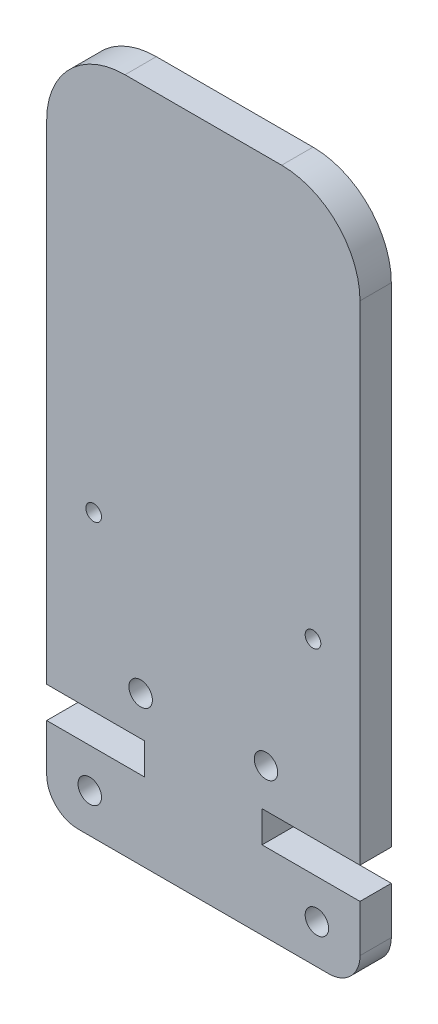
ISO-10303-21;
HEADER;
FILE_DESCRIPTION(('STEP AP214'),'2;1');
FILE_NAME('part.step','',(''),(''),'','','');
FILE_SCHEMA(('AUTOMOTIVE_DESIGN { 1 0 10303 214 1 1 1 1 }'));
ENDSEC;
DATA;
#1=APPLICATION_CONTEXT('core data for automotive mechanical design processes');
#2=APPLICATION_PROTOCOL_DEFINITION('international standard','automotive_design',2000,#1);
#3=PRODUCT_CONTEXT('',#1,'mechanical');
#4=PRODUCT('Part','Part','',(#3));
#5=PRODUCT_RELATED_PRODUCT_CATEGORY('part','',(#4));
#6=PRODUCT_DEFINITION_FORMATION('','',#4);
#7=PRODUCT_DEFINITION_CONTEXT('part definition',#1,'design');
#8=PRODUCT_DEFINITION('design','',#6,#7);
#9=PRODUCT_DEFINITION_SHAPE('','',#8);
#10=(LENGTH_UNIT() NAMED_UNIT(*) SI_UNIT(.MILLI.,.METRE.));
#11=(NAMED_UNIT(*) PLANE_ANGLE_UNIT() SI_UNIT($,.RADIAN.));
#12=(NAMED_UNIT(*) SI_UNIT($,.STERADIAN.) SOLID_ANGLE_UNIT());
#13=UNCERTAINTY_MEASURE_WITH_UNIT(LENGTH_MEASURE(1.E-05),#10,'distance_accuracy_value','');
#14=(GEOMETRIC_REPRESENTATION_CONTEXT(3) GLOBAL_UNCERTAINTY_ASSIGNED_CONTEXT((#13)) GLOBAL_UNIT_ASSIGNED_CONTEXT((#10,
#11,#12)) REPRESENTATION_CONTEXT('',''));
#15=CARTESIAN_POINT('',(0.,0.,0.));
#16=DIRECTION('',(0.,0.,1.));
#17=DIRECTION('',(1.,0.,0.));
#18=AXIS2_PLACEMENT_3D('',#15,#16,#17);
#19=CARTESIAN_POINT('',(18.,2.,2.));
#20=DIRECTION('',(0.,0.,1.));
#21=DIRECTION('',(1.,0.,0.));
#22=AXIS2_PLACEMENT_3D('',#19,#20,#21);
#23=PLANE('',#22);
#24=CARTESIAN_POINT('',(17.2500000000022,2.49999999999995,2.));
#25=DIRECTION('',(0.,0.,1.));
#26=DIRECTION('',(1.,0.,0.));
#27=AXIS2_PLACEMENT_3D('',#24,#25,#26);
#28=CIRCLE('',#27,0.749999999999969);
#29=CARTESIAN_POINT('',(18.0000000000022,2.49999999999995,2.));
#30=VERTEX_POINT('',#29);
#31=EDGE_CURVE('E352',#30,#30,#28,.T.);
#32=ORIENTED_EDGE('',*,*,#31,.F.);
#33=EDGE_LOOP('',(#32));
#34=FACE_BOUND('',#33,.T.);
#35=CARTESIAN_POINT('',(14.0000000000031,9.50000000000006,2.));
#36=DIRECTION('',(0.,0.,1.));
#37=DIRECTION('',(1.,0.,0.));
#38=AXIS2_PLACEMENT_3D('',#35,#36,#37);
#39=CIRCLE('',#38,0.750000000000027);
#40=CARTESIAN_POINT('',(14.7500000000031,9.50000000000006,2.));
#41=VERTEX_POINT('',#40);
#42=EDGE_CURVE('E364',#41,#41,#39,.T.);
#43=ORIENTED_EDGE('',*,*,#42,.F.);
#44=EDGE_LOOP('',(#43));
#45=FACE_BOUND('',#44,.T.);
#46=CARTESIAN_POINT('',(3.00000000000211,18.,2.));
#47=DIRECTION('',(0.,0.,1.));
#48=DIRECTION('',(1.,0.,0.));
#49=AXIS2_PLACEMENT_3D('',#46,#47,#48);
#50=CIRCLE('',#49,0.499999999999946);
#51=CARTESIAN_POINT('',(3.50000000000205,18.,2.));
#52=VERTEX_POINT('',#51);
#53=EDGE_CURVE('E182',#52,#52,#50,.T.);
#54=ORIENTED_EDGE('',*,*,#53,.F.);
#55=EDGE_LOOP('',(#54));
#56=FACE_BOUND('',#55,.T.);
#57=CARTESIAN_POINT('',(18.,2.,2.));
#58=DIRECTION('',(0.,0.,1.));
#59=DIRECTION('',(1.,0.,0.));
#60=AXIS2_PLACEMENT_3D('',#57,#58,#59);
#61=CIRCLE('',#60,2.);
#62=CARTESIAN_POINT('',(18.,0.,2.));
#63=VERTEX_POINT('',#62);
#64=CARTESIAN_POINT('',(20.,2.,2.));
#65=VERTEX_POINT('',#64);
#66=EDGE_CURVE('E209',#63,#65,#61,.T.);
#67=ORIENTED_EDGE('',*,*,#66,.T.);
#68=DIRECTION('',(0.,1.,0.));
#69=VECTOR('',#68,1.);
#70=CARTESIAN_POINT('',(20.,5.00000000000012,2.));
#71=LINE('',#70,#69);
#72=CARTESIAN_POINT('',(20.,5.00000000000012,2.));
#73=VERTEX_POINT('',#72);
#74=EDGE_CURVE('E117',#65,#73,#71,.T.);
#75=ORIENTED_EDGE('',*,*,#74,.T.);
#76=DIRECTION('',(-1.,0.,0.));
#77=VECTOR('',#76,1.);
#78=CARTESIAN_POINT('',(13.749999999998,5.00000000000012,2.));
#79=LINE('',#78,#77);
#80=CARTESIAN_POINT('',(13.749999999998,5.00000000000012,2.));
#81=VERTEX_POINT('',#80);
#82=EDGE_CURVE('E248',#73,#81,#79,.T.);
#83=ORIENTED_EDGE('',*,*,#82,.T.);
#84=DIRECTION('',(0.,1.,0.));
#85=VECTOR('',#84,1.);
#86=CARTESIAN_POINT('',(13.749999999998,5.00000000000012,2.));
#87=LINE('',#86,#85);
#88=CARTESIAN_POINT('',(13.749999999998,7.00000000000012,2.));
#89=VERTEX_POINT('',#88);
#90=EDGE_CURVE('E267',#81,#89,#87,.T.);
#91=ORIENTED_EDGE('',*,*,#90,.T.);
#92=DIRECTION('',(1.,0.,0.));
#93=VECTOR('',#92,1.);
#94=CARTESIAN_POINT('',(13.749999999998,7.00000000000012,2.));
#95=LINE('',#94,#93);
#96=CARTESIAN_POINT('',(20.,7.00000000000012,2.));
#97=VERTEX_POINT('',#96);
#98=EDGE_CURVE('E264',#89,#97,#95,.T.);
#99=ORIENTED_EDGE('',*,*,#98,.T.);
#100=DIRECTION('',(0.,1.,0.));
#101=VECTOR('',#100,1.);
#102=CARTESIAN_POINT('',(20.,7.00000000000012,2.));
#103=LINE('',#102,#101);
#104=CARTESIAN_POINT('',(20.,38.2000000000002,2.));
#105=VERTEX_POINT('',#104);
#106=EDGE_CURVE('E266',#97,#105,#103,.T.);
#107=ORIENTED_EDGE('',*,*,#106,.T.);
#108=CARTESIAN_POINT('',(15.,38.2000000000002,2.));
#109=DIRECTION('',(0.,0.,1.));
#110=DIRECTION('',(1.,0.,0.));
#111=AXIS2_PLACEMENT_3D('',#108,#109,#110);
#112=CIRCLE('',#111,5.);
#113=CARTESIAN_POINT('',(15.,43.2000000000002,2.));
#114=VERTEX_POINT('',#113);
#115=EDGE_CURVE('E269',#105,#114,#112,.T.);
#116=ORIENTED_EDGE('',*,*,#115,.T.);
#117=DIRECTION('',(-1.,0.,0.));
#118=VECTOR('',#117,1.);
#119=CARTESIAN_POINT('',(5.,43.2000000000002,2.));
#120=LINE('',#119,#118);
#121=CARTESIAN_POINT('',(5.,43.2000000000002,2.));
#122=VERTEX_POINT('',#121);
#123=EDGE_CURVE('E275',#114,#122,#120,.T.);
#124=ORIENTED_EDGE('',*,*,#123,.T.);
#125=CARTESIAN_POINT('',(5.,38.2000000000002,2.));
#126=DIRECTION('',(0.,0.,1.));
#127=DIRECTION('',(1.,0.,0.));
#128=AXIS2_PLACEMENT_3D('',#125,#126,#127);
#129=CIRCLE('',#128,5.);
#130=CARTESIAN_POINT('',(0.,38.2000000000002,2.));
#131=VERTEX_POINT('',#130);
#132=EDGE_CURVE('E277',#122,#131,#129,.T.);
#133=ORIENTED_EDGE('',*,*,#132,.T.);
#134=DIRECTION('',(0.,-1.,0.));
#135=VECTOR('',#134,1.);
#136=CARTESIAN_POINT('',(0.,38.2000000000002,2.));
#137=LINE('',#136,#135);
#138=CARTESIAN_POINT('',(0.,7.00000000000012,2.));
#139=VERTEX_POINT('',#138);
#140=EDGE_CURVE('E279',#131,#139,#137,.T.);
#141=ORIENTED_EDGE('',*,*,#140,.T.);
#142=DIRECTION('',(1.,0.,0.));
#143=VECTOR('',#142,1.);
#144=CARTESIAN_POINT('',(6.25000000000197,7.00000000000012,2.));
#145=LINE('',#144,#143);
#146=CARTESIAN_POINT('',(6.25000000000197,7.00000000000012,2.));
#147=VERTEX_POINT('',#146);
#148=EDGE_CURVE('E281',#139,#147,#145,.T.);
#149=ORIENTED_EDGE('',*,*,#148,.T.);
#150=DIRECTION('',(0.,-1.,0.));
#151=VECTOR('',#150,1.);
#152=CARTESIAN_POINT('',(6.25000000000197,5.00000000000012,2.));
#153=LINE('',#152,#151);
#154=CARTESIAN_POINT('',(6.25000000000197,5.00000000000012,2.));
#155=VERTEX_POINT('',#154);
#156=EDGE_CURVE('E283',#147,#155,#153,.T.);
#157=ORIENTED_EDGE('',*,*,#156,.T.);
#158=DIRECTION('',(-1.,0.,0.));
#159=VECTOR('',#158,1.);
#160=CARTESIAN_POINT('',(6.25000000000197,5.00000000000012,2.));
#161=LINE('',#160,#159);
#162=CARTESIAN_POINT('',(0.,5.00000000000012,2.));
#163=VERTEX_POINT('',#162);
#164=EDGE_CURVE('E160',#155,#163,#161,.T.);
#165=ORIENTED_EDGE('',*,*,#164,.T.);
#166=DIRECTION('',(0.,-1.,0.));
#167=VECTOR('',#166,1.);
#168=CARTESIAN_POINT('',(0.,5.00000000000012,2.));
#169=LINE('',#168,#167);
#170=CARTESIAN_POINT('',(0.,2.,2.));
#171=VERTEX_POINT('',#170);
#172=EDGE_CURVE('E154',#163,#171,#169,.T.);
#173=ORIENTED_EDGE('',*,*,#172,.T.);
#174=CARTESIAN_POINT('',(2.,2.,2.));
#175=DIRECTION('',(0.,0.,1.));
#176=DIRECTION('',(1.,0.,0.));
#177=AXIS2_PLACEMENT_3D('',#174,#175,#176);
#178=CIRCLE('',#177,2.);
#179=CARTESIAN_POINT('',(2.,0.,2.));
#180=VERTEX_POINT('',#179);
#181=EDGE_CURVE('E158',#171,#180,#178,.T.);
#182=ORIENTED_EDGE('',*,*,#181,.T.);
#183=DIRECTION('',(1.,0.,0.));
#184=VECTOR('',#183,1.);
#185=CARTESIAN_POINT('',(2.,0.,2.));
#186=LINE('',#185,#184);
#187=EDGE_CURVE('E50',#180,#63,#186,.T.);
#188=ORIENTED_EDGE('',*,*,#187,.T.);
#189=EDGE_LOOP('',(#67,#75,#83,#91,#99,#107,#116,#124,#133,#141,#149,#157,#165,#173,#182,#188));
#190=FACE_BOUND('',#189,.T.);
#191=CARTESIAN_POINT('',(17.0000000000021,18.,2.));
#192=DIRECTION('',(0.,0.,1.));
#193=DIRECTION('',(1.,0.,0.));
#194=AXIS2_PLACEMENT_3D('',#191,#192,#193);
#195=CIRCLE('',#194,0.499999999999949);
#196=CARTESIAN_POINT('',(17.5000000000021,18.,2.));
#197=VERTEX_POINT('',#196);
#198=EDGE_CURVE('E370',#197,#197,#195,.T.);
#199=ORIENTED_EDGE('',*,*,#198,.F.);
#200=EDGE_LOOP('',(#199));
#201=FACE_BOUND('',#200,.T.);
#202=CARTESIAN_POINT('',(6.00000000000311,9.50000000000006,2.));
#203=DIRECTION('',(0.,0.,1.));
#204=DIRECTION('',(1.,0.,0.));
#205=AXIS2_PLACEMENT_3D('',#202,#203,#204);
#206=CIRCLE('',#205,0.750000000000027);
#207=CARTESIAN_POINT('',(6.75000000000314,9.50000000000006,2.));
#208=VERTEX_POINT('',#207);
#209=EDGE_CURVE('E358',#208,#208,#206,.T.);
#210=ORIENTED_EDGE('',*,*,#209,.F.);
#211=EDGE_LOOP('',(#210));
#212=FACE_BOUND('',#211,.T.);
#213=CARTESIAN_POINT('',(2.75000000000203,2.49999999999995,2.));
#214=DIRECTION('',(0.,0.,1.));
#215=DIRECTION('',(1.,0.,0.));
#216=AXIS2_PLACEMENT_3D('',#213,#214,#215);
#217=CIRCLE('',#216,0.750000000000027);
#218=CARTESIAN_POINT('',(3.50000000000205,2.49999999999995,2.));
#219=VERTEX_POINT('',#218);
#220=EDGE_CURVE('E343',#219,#219,#217,.T.);
#221=ORIENTED_EDGE('',*,*,#220,.F.);
#222=EDGE_LOOP('',(#221));
#223=FACE_BOUND('',#222,.T.);
#224=ADVANCED_FACE('F33',(#34,#45,#56,#190,#201,#212,#223),#23,.T.);
#225=CARTESIAN_POINT('',(18.,2.,0.));
#226=DIRECTION('',(0.,0.,1.));
#227=DIRECTION('',(1.,0.,0.));
#228=AXIS2_PLACEMENT_3D('',#225,#226,#227);
#229=PLANE('',#228);
#230=CARTESIAN_POINT('',(17.2500000000022,2.49999999999995,0.));
#231=DIRECTION('',(0.,0.,1.));
#232=DIRECTION('',(1.,0.,0.));
#233=AXIS2_PLACEMENT_3D('',#230,#231,#232);
#234=CIRCLE('',#233,0.749999999999969);
#235=CARTESIAN_POINT('',(18.0000000000022,2.49999999999995,0.));
#236=VERTEX_POINT('',#235);
#237=EDGE_CURVE('E349',#236,#236,#234,.T.);
#238=ORIENTED_EDGE('',*,*,#237,.T.);
#239=EDGE_LOOP('',(#238));
#240=FACE_BOUND('',#239,.T.);
#241=CARTESIAN_POINT('',(14.0000000000031,9.50000000000006,0.));
#242=DIRECTION('',(0.,0.,1.));
#243=DIRECTION('',(1.,0.,0.));
#244=AXIS2_PLACEMENT_3D('',#241,#242,#243);
#245=CIRCLE('',#244,0.750000000000027);
#246=CARTESIAN_POINT('',(14.7500000000031,9.50000000000006,0.));
#247=VERTEX_POINT('',#246);
#248=EDGE_CURVE('E361',#247,#247,#245,.T.);
#249=ORIENTED_EDGE('',*,*,#248,.T.);
#250=EDGE_LOOP('',(#249));
#251=FACE_BOUND('',#250,.T.);
#252=CARTESIAN_POINT('',(3.00000000000211,18.,0.));
#253=DIRECTION('',(0.,0.,1.));
#254=DIRECTION('',(1.,0.,0.));
#255=AXIS2_PLACEMENT_3D('',#252,#253,#254);
#256=CIRCLE('',#255,0.499999999999946);
#257=CARTESIAN_POINT('',(3.50000000000205,18.,0.));
#258=VERTEX_POINT('',#257);
#259=EDGE_CURVE('E373',#258,#258,#256,.T.);
#260=ORIENTED_EDGE('',*,*,#259,.T.);
#261=EDGE_LOOP('',(#260));
#262=FACE_BOUND('',#261,.T.);
#263=CARTESIAN_POINT('',(18.,2.,0.));
#264=DIRECTION('',(0.,0.,1.));
#265=DIRECTION('',(1.,0.,0.));
#266=AXIS2_PLACEMENT_3D('',#263,#264,#265);
#267=CIRCLE('',#266,2.);
#268=CARTESIAN_POINT('',(18.,0.,0.));
#269=VERTEX_POINT('',#268);
#270=CARTESIAN_POINT('',(20.,2.,0.));
#271=VERTEX_POINT('',#270);
#272=EDGE_CURVE('E178',#269,#271,#267,.T.);
#273=ORIENTED_EDGE('',*,*,#272,.F.);
#274=DIRECTION('',(1.,0.,0.));
#275=VECTOR('',#274,1.);
#276=CARTESIAN_POINT('',(2.,0.,0.));
#277=LINE('',#276,#275);
#278=CARTESIAN_POINT('',(2.,0.,0.));
#279=VERTEX_POINT('',#278);
#280=EDGE_CURVE('E109',#279,#269,#277,.T.);
#281=ORIENTED_EDGE('',*,*,#280,.F.);
#282=CARTESIAN_POINT('',(2.,2.,0.));
#283=DIRECTION('',(0.,0.,1.));
#284=DIRECTION('',(1.,0.,0.));
#285=AXIS2_PLACEMENT_3D('',#282,#283,#284);
#286=CIRCLE('',#285,2.);
#287=CARTESIAN_POINT('',(0.,2.,0.));
#288=VERTEX_POINT('',#287);
#289=EDGE_CURVE('E103',#288,#279,#286,.T.);
#290=ORIENTED_EDGE('',*,*,#289,.F.);
#291=DIRECTION('',(0.,-1.,0.));
#292=VECTOR('',#291,1.);
#293=CARTESIAN_POINT('',(0.,5.00000000000012,0.));
#294=LINE('',#293,#292);
#295=CARTESIAN_POINT('',(0.,5.00000000000012,0.));
#296=VERTEX_POINT('',#295);
#297=EDGE_CURVE('E168',#296,#288,#294,.T.);
#298=ORIENTED_EDGE('',*,*,#297,.F.);
#299=DIRECTION('',(-1.,0.,0.));
#300=VECTOR('',#299,1.);
#301=CARTESIAN_POINT('',(6.25000000000197,5.00000000000012,0.));
#302=LINE('',#301,#300);
#303=CARTESIAN_POINT('',(6.25000000000197,5.00000000000012,0.));
#304=VERTEX_POINT('',#303);
#305=EDGE_CURVE('E204',#304,#296,#302,.T.);
#306=ORIENTED_EDGE('',*,*,#305,.F.);
#307=DIRECTION('',(0.,-1.,0.));
#308=VECTOR('',#307,1.);
#309=CARTESIAN_POINT('',(6.25000000000197,5.00000000000012,0.));
#310=LINE('',#309,#308);
#311=CARTESIAN_POINT('',(6.25000000000197,7.00000000000012,0.));
#312=VERTEX_POINT('',#311);
#313=EDGE_CURVE('E202',#312,#304,#310,.T.);
#314=ORIENTED_EDGE('',*,*,#313,.F.);
#315=DIRECTION('',(1.,0.,0.));
#316=VECTOR('',#315,1.);
#317=CARTESIAN_POINT('',(6.25000000000197,7.00000000000012,0.));
#318=LINE('',#317,#316);
#319=CARTESIAN_POINT('',(0.,7.00000000000012,0.));
#320=VERTEX_POINT('',#319);
#321=EDGE_CURVE('E200',#320,#312,#318,.T.);
#322=ORIENTED_EDGE('',*,*,#321,.F.);
#323=DIRECTION('',(0.,-1.,0.));
#324=VECTOR('',#323,1.);
#325=CARTESIAN_POINT('',(0.,38.2000000000002,0.));
#326=LINE('',#325,#324);
#327=CARTESIAN_POINT('',(0.,38.2000000000002,0.));
#328=VERTEX_POINT('',#327);
#329=EDGE_CURVE('E198',#328,#320,#326,.T.);
#330=ORIENTED_EDGE('',*,*,#329,.F.);
#331=CARTESIAN_POINT('',(5.,38.2000000000002,0.));
#332=DIRECTION('',(0.,0.,1.));
#333=DIRECTION('',(1.,0.,0.));
#334=AXIS2_PLACEMENT_3D('',#331,#332,#333);
#335=CIRCLE('',#334,5.);
#336=CARTESIAN_POINT('',(5.,43.2000000000002,0.));
#337=VERTEX_POINT('',#336);
#338=EDGE_CURVE('E196',#337,#328,#335,.T.);
#339=ORIENTED_EDGE('',*,*,#338,.F.);
#340=DIRECTION('',(-1.,0.,0.));
#341=VECTOR('',#340,1.);
#342=CARTESIAN_POINT('',(5.,43.2000000000002,0.));
#343=LINE('',#342,#341);
#344=CARTESIAN_POINT('',(15.,43.2000000000002,0.));
#345=VERTEX_POINT('',#344);
#346=EDGE_CURVE('E194',#345,#337,#343,.T.);
#347=ORIENTED_EDGE('',*,*,#346,.F.);
#348=CARTESIAN_POINT('',(15.,38.2000000000002,0.));
#349=DIRECTION('',(0.,0.,1.));
#350=DIRECTION('',(1.,0.,0.));
#351=AXIS2_PLACEMENT_3D('',#348,#349,#350);
#352=CIRCLE('',#351,5.);
#353=CARTESIAN_POINT('',(20.,38.2000000000002,0.));
#354=VERTEX_POINT('',#353);
#355=EDGE_CURVE('E192',#354,#345,#352,.T.);
#356=ORIENTED_EDGE('',*,*,#355,.F.);
#357=DIRECTION('',(0.,1.,0.));
#358=VECTOR('',#357,1.);
#359=CARTESIAN_POINT('',(20.,7.00000000000012,0.));
#360=LINE('',#359,#358);
#361=CARTESIAN_POINT('',(20.,7.00000000000012,0.));
#362=VERTEX_POINT('',#361);
#363=EDGE_CURVE('E190',#362,#354,#360,.T.);
#364=ORIENTED_EDGE('',*,*,#363,.F.);
#365=DIRECTION('',(1.,0.,0.));
#366=VECTOR('',#365,1.);
#367=CARTESIAN_POINT('',(13.749999999998,7.00000000000012,0.));
#368=LINE('',#367,#366);
#369=CARTESIAN_POINT('',(13.749999999998,7.00000000000012,0.));
#370=VERTEX_POINT('',#369);
#371=EDGE_CURVE('E188',#370,#362,#368,.T.);
#372=ORIENTED_EDGE('',*,*,#371,.F.);
#373=DIRECTION('',(0.,1.,0.));
#374=VECTOR('',#373,1.);
#375=CARTESIAN_POINT('',(13.749999999998,5.00000000000012,0.));
#376=LINE('',#375,#374);
#377=CARTESIAN_POINT('',(13.749999999998,5.00000000000012,0.));
#378=VERTEX_POINT('',#377);
#379=EDGE_CURVE('E186',#378,#370,#376,.T.);
#380=ORIENTED_EDGE('',*,*,#379,.F.);
#381=DIRECTION('',(-1.,0.,0.));
#382=VECTOR('',#381,1.);
#383=CARTESIAN_POINT('',(13.749999999998,5.00000000000012,0.));
#384=LINE('',#383,#382);
#385=CARTESIAN_POINT('',(20.,5.00000000000012,0.));
#386=VERTEX_POINT('',#385);
#387=EDGE_CURVE('E184',#386,#378,#384,.T.);
#388=ORIENTED_EDGE('',*,*,#387,.F.);
#389=DIRECTION('',(0.,1.,0.));
#390=VECTOR('',#389,1.);
#391=CARTESIAN_POINT('',(20.,5.00000000000012,0.));
#392=LINE('',#391,#390);
#393=EDGE_CURVE('E181',#271,#386,#392,.T.);
#394=ORIENTED_EDGE('',*,*,#393,.F.);
#395=EDGE_LOOP('',(#273,#281,#290,#298,#306,#314,#322,#330,#339,#347,#356,#364,#372,#380,#388,#394));
#396=FACE_BOUND('',#395,.T.);
#397=CARTESIAN_POINT('',(17.0000000000021,18.,0.));
#398=DIRECTION('',(0.,0.,1.));
#399=DIRECTION('',(1.,0.,0.));
#400=AXIS2_PLACEMENT_3D('',#397,#398,#399);
#401=CIRCLE('',#400,0.499999999999949);
#402=CARTESIAN_POINT('',(17.5000000000021,18.,0.));
#403=VERTEX_POINT('',#402);
#404=EDGE_CURVE('E367',#403,#403,#401,.T.);
#405=ORIENTED_EDGE('',*,*,#404,.T.);
#406=EDGE_LOOP('',(#405));
#407=FACE_BOUND('',#406,.T.);
#408=CARTESIAN_POINT('',(6.00000000000311,9.50000000000006,0.));
#409=DIRECTION('',(0.,0.,1.));
#410=DIRECTION('',(1.,0.,0.));
#411=AXIS2_PLACEMENT_3D('',#408,#409,#410);
#412=CIRCLE('',#411,0.750000000000027);
#413=CARTESIAN_POINT('',(6.75000000000314,9.50000000000006,0.));
#414=VERTEX_POINT('',#413);
#415=EDGE_CURVE('E355',#414,#414,#412,.T.);
#416=ORIENTED_EDGE('',*,*,#415,.T.);
#417=EDGE_LOOP('',(#416));
#418=FACE_BOUND('',#417,.T.);
#419=CARTESIAN_POINT('',(2.75000000000203,2.49999999999995,0.));
#420=DIRECTION('',(0.,0.,1.));
#421=DIRECTION('',(1.,0.,0.));
#422=AXIS2_PLACEMENT_3D('',#419,#420,#421);
#423=CIRCLE('',#422,0.750000000000027);
#424=CARTESIAN_POINT('',(3.50000000000205,2.49999999999995,0.));
#425=VERTEX_POINT('',#424);
#426=EDGE_CURVE('E346',#425,#425,#423,.T.);
#427=ORIENTED_EDGE('',*,*,#426,.T.);
#428=EDGE_LOOP('',(#427));
#429=FACE_BOUND('',#428,.T.);
#430=ADVANCED_FACE('F252',(#240,#251,#262,#396,#407,#418,#429),#229,.F.);
#431=CARTESIAN_POINT('',(18.,2.,2.));
#432=DIRECTION('',(0.,0.,-1.));
#433=DIRECTION('',(-1.,0.,0.));
#434=AXIS2_PLACEMENT_3D('',#431,#432,#433);
#435=CYLINDRICAL_SURFACE('',#434,2.);
#436=ORIENTED_EDGE('',*,*,#272,.T.);
#437=DIRECTION('',(0.,0.,-1.));
#438=VECTOR('',#437,1.);
#439=CARTESIAN_POINT('',(20.,2.,2.));
#440=LINE('',#439,#438);
#441=EDGE_CURVE('E11',#65,#271,#440,.T.);
#442=ORIENTED_EDGE('',*,*,#441,.F.);
#443=ORIENTED_EDGE('',*,*,#66,.F.);
#444=DIRECTION('',(0.,0.,-1.));
#445=VECTOR('',#444,1.);
#446=CARTESIAN_POINT('',(18.,0.,2.));
#447=LINE('',#446,#445);
#448=EDGE_CURVE('E174',#63,#269,#447,.T.);
#449=ORIENTED_EDGE('',*,*,#448,.T.);
#450=EDGE_LOOP('',(#436,#442,#443,#449));
#451=FACE_BOUND('',#450,.T.);
#452=ADVANCED_FACE('F35',(#451),#435,.T.);
#453=CARTESIAN_POINT('',(20.,5.00000000000012,2.));
#454=DIRECTION('',(-1.,0.,0.));
#455=DIRECTION('',(0.,0.,1.));
#456=AXIS2_PLACEMENT_3D('',#453,#454,#455);
#457=PLANE('',#456);
#458=ORIENTED_EDGE('',*,*,#393,.T.);
#459=DIRECTION('',(0.,0.,-1.));
#460=VECTOR('',#459,1.);
#461=CARTESIAN_POINT('',(20.,5.00000000000012,2.));
#462=LINE('',#461,#460);
#463=EDGE_CURVE('E42',#73,#386,#462,.T.);
#464=ORIENTED_EDGE('',*,*,#463,.F.);
#465=ORIENTED_EDGE('',*,*,#74,.F.);
#466=ORIENTED_EDGE('',*,*,#441,.T.);
#467=EDGE_LOOP('',(#458,#464,#465,#466));
#468=FACE_BOUND('',#467,.T.);
#469=ADVANCED_FACE('F540',(#468),#457,.F.);
#470=CARTESIAN_POINT('',(13.749999999998,5.00000000000012,2.));
#471=DIRECTION('',(0.,-1.,0.));
#472=DIRECTION('',(0.,0.,-1.));
#473=AXIS2_PLACEMENT_3D('',#470,#471,#472);
#474=PLANE('',#473);
#475=ORIENTED_EDGE('',*,*,#387,.T.);
#476=DIRECTION('',(0.,0.,-1.));
#477=VECTOR('',#476,1.);
#478=CARTESIAN_POINT('',(13.749999999998,5.00000000000012,2.));
#479=LINE('',#478,#477);
#480=EDGE_CURVE('E240',#81,#378,#479,.T.);
#481=ORIENTED_EDGE('',*,*,#480,.F.);
#482=ORIENTED_EDGE('',*,*,#82,.F.);
#483=ORIENTED_EDGE('',*,*,#463,.T.);
#484=EDGE_LOOP('',(#475,#481,#482,#483));
#485=FACE_BOUND('',#484,.T.);
#486=ADVANCED_FACE('F246',(#485),#474,.F.);
#487=CARTESIAN_POINT('',(13.749999999998,5.00000000000012,2.));
#488=DIRECTION('',(-1.,0.,0.));
#489=DIRECTION('',(0.,0.,1.));
#490=AXIS2_PLACEMENT_3D('',#487,#488,#489);
#491=PLANE('',#490);
#492=ORIENTED_EDGE('',*,*,#379,.T.);
#493=DIRECTION('',(0.,0.,-1.));
#494=VECTOR('',#493,1.);
#495=CARTESIAN_POINT('',(13.749999999998,7.00000000000012,2.));
#496=LINE('',#495,#494);
#497=EDGE_CURVE('E237',#89,#370,#496,.T.);
#498=ORIENTED_EDGE('',*,*,#497,.F.);
#499=ORIENTED_EDGE('',*,*,#90,.F.);
#500=ORIENTED_EDGE('',*,*,#480,.T.);
#501=EDGE_LOOP('',(#492,#498,#499,#500));
#502=FACE_BOUND('',#501,.T.);
#503=ADVANCED_FACE('F258',(#502),#491,.F.);
#504=CARTESIAN_POINT('',(13.749999999998,7.00000000000012,2.));
#505=DIRECTION('',(0.,1.,0.));
#506=DIRECTION('',(0.,0.,1.));
#507=AXIS2_PLACEMENT_3D('',#504,#505,#506);
#508=PLANE('',#507);
#509=ORIENTED_EDGE('',*,*,#371,.T.);
#510=DIRECTION('',(0.,0.,-1.));
#511=VECTOR('',#510,1.);
#512=CARTESIAN_POINT('',(20.,7.00000000000012,2.));
#513=LINE('',#512,#511);
#514=EDGE_CURVE('E234',#97,#362,#513,.T.);
#515=ORIENTED_EDGE('',*,*,#514,.F.);
#516=ORIENTED_EDGE('',*,*,#98,.F.);
#517=ORIENTED_EDGE('',*,*,#497,.T.);
#518=EDGE_LOOP('',(#509,#515,#516,#517));
#519=FACE_BOUND('',#518,.T.);
#520=ADVANCED_FACE('F262',(#519),#508,.F.);
#521=CARTESIAN_POINT('',(20.,7.00000000000012,2.));
#522=DIRECTION('',(-1.,0.,0.));
#523=DIRECTION('',(0.,0.,1.));
#524=AXIS2_PLACEMENT_3D('',#521,#522,#523);
#525=PLANE('',#524);
#526=ORIENTED_EDGE('',*,*,#363,.T.);
#527=DIRECTION('',(0.,0.,-1.));
#528=VECTOR('',#527,1.);
#529=CARTESIAN_POINT('',(20.,38.2000000000002,2.));
#530=LINE('',#529,#528);
#531=EDGE_CURVE('E231',#105,#354,#530,.T.);
#532=ORIENTED_EDGE('',*,*,#531,.F.);
#533=ORIENTED_EDGE('',*,*,#106,.F.);
#534=ORIENTED_EDGE('',*,*,#514,.T.);
#535=EDGE_LOOP('',(#526,#532,#533,#534));
#536=FACE_BOUND('',#535,.T.);
#537=ADVANCED_FACE('F505',(#536),#525,.F.);
#538=CARTESIAN_POINT('',(15.,38.2000000000002,2.));
#539=DIRECTION('',(0.,0.,-1.));
#540=DIRECTION('',(-1.,0.,0.));
#541=AXIS2_PLACEMENT_3D('',#538,#539,#540);
#542=CYLINDRICAL_SURFACE('',#541,5.);
#543=ORIENTED_EDGE('',*,*,#355,.T.);
#544=DIRECTION('',(0.,0.,-1.));
#545=VECTOR('',#544,1.);
#546=CARTESIAN_POINT('',(15.,43.2000000000002,2.));
#547=LINE('',#546,#545);
#548=EDGE_CURVE('E228',#114,#345,#547,.T.);
#549=ORIENTED_EDGE('',*,*,#548,.F.);
#550=ORIENTED_EDGE('',*,*,#115,.F.);
#551=ORIENTED_EDGE('',*,*,#531,.T.);
#552=EDGE_LOOP('',(#543,#549,#550,#551));
#553=FACE_BOUND('',#552,.T.);
#554=ADVANCED_FACE('F495',(#553),#542,.T.);
#555=CARTESIAN_POINT('',(5.,43.2000000000002,2.));
#556=DIRECTION('',(0.,-1.,0.));
#557=DIRECTION('',(0.,0.,-1.));
#558=AXIS2_PLACEMENT_3D('',#555,#556,#557);
#559=PLANE('',#558);
#560=ORIENTED_EDGE('',*,*,#346,.T.);
#561=DIRECTION('',(0.,0.,-1.));
#562=VECTOR('',#561,1.);
#563=CARTESIAN_POINT('',(5.,43.2000000000002,2.));
#564=LINE('',#563,#562);
#565=EDGE_CURVE('E225',#122,#337,#564,.T.);
#566=ORIENTED_EDGE('',*,*,#565,.F.);
#567=ORIENTED_EDGE('',*,*,#123,.F.);
#568=ORIENTED_EDGE('',*,*,#548,.T.);
#569=EDGE_LOOP('',(#560,#566,#567,#568));
#570=FACE_BOUND('',#569,.T.);
#571=ADVANCED_FACE('F485',(#570),#559,.F.);
#572=CARTESIAN_POINT('',(5.,38.2000000000002,2.));
#573=DIRECTION('',(0.,0.,-1.));
#574=DIRECTION('',(-1.,0.,0.));
#575=AXIS2_PLACEMENT_3D('',#572,#573,#574);
#576=CYLINDRICAL_SURFACE('',#575,5.);
#577=ORIENTED_EDGE('',*,*,#338,.T.);
#578=DIRECTION('',(0.,0.,-1.));
#579=VECTOR('',#578,1.);
#580=CARTESIAN_POINT('',(0.,38.2000000000002,2.));
#581=LINE('',#580,#579);
#582=EDGE_CURVE('E222',#131,#328,#581,.T.);
#583=ORIENTED_EDGE('',*,*,#582,.F.);
#584=ORIENTED_EDGE('',*,*,#132,.F.);
#585=ORIENTED_EDGE('',*,*,#565,.T.);
#586=EDGE_LOOP('',(#577,#583,#584,#585));
#587=FACE_BOUND('',#586,.T.);
#588=ADVANCED_FACE('F475',(#587),#576,.T.);
#589=CARTESIAN_POINT('',(0.,38.2000000000002,2.));
#590=DIRECTION('',(1.,0.,0.));
#591=DIRECTION('',(0.,0.,-1.));
#592=AXIS2_PLACEMENT_3D('',#589,#590,#591);
#593=PLANE('',#592);
#594=ORIENTED_EDGE('',*,*,#329,.T.);
#595=DIRECTION('',(0.,0.,-1.));
#596=VECTOR('',#595,1.);
#597=CARTESIAN_POINT('',(0.,7.00000000000012,2.));
#598=LINE('',#597,#596);
#599=EDGE_CURVE('E219',#139,#320,#598,.T.);
#600=ORIENTED_EDGE('',*,*,#599,.F.);
#601=ORIENTED_EDGE('',*,*,#140,.F.);
#602=ORIENTED_EDGE('',*,*,#582,.T.);
#603=EDGE_LOOP('',(#594,#600,#601,#602));
#604=FACE_BOUND('',#603,.T.);
#605=ADVANCED_FACE('F465',(#604),#593,.F.);
#606=CARTESIAN_POINT('',(6.25000000000197,7.00000000000012,2.));
#607=DIRECTION('',(0.,1.,0.));
#608=DIRECTION('',(0.,0.,1.));
#609=AXIS2_PLACEMENT_3D('',#606,#607,#608);
#610=PLANE('',#609);
#611=ORIENTED_EDGE('',*,*,#321,.T.);
#612=DIRECTION('',(0.,0.,-1.));
#613=VECTOR('',#612,1.);
#614=CARTESIAN_POINT('',(6.25000000000197,7.00000000000012,2.));
#615=LINE('',#614,#613);
#616=EDGE_CURVE('E216',#147,#312,#615,.T.);
#617=ORIENTED_EDGE('',*,*,#616,.F.);
#618=ORIENTED_EDGE('',*,*,#148,.F.);
#619=ORIENTED_EDGE('',*,*,#599,.T.);
#620=EDGE_LOOP('',(#611,#617,#618,#619));
#621=FACE_BOUND('',#620,.T.);
#622=ADVANCED_FACE('F456',(#621),#610,.F.);
#623=CARTESIAN_POINT('',(6.25000000000197,5.00000000000012,2.));
#624=DIRECTION('',(1.,0.,0.));
#625=DIRECTION('',(0.,0.,-1.));
#626=AXIS2_PLACEMENT_3D('',#623,#624,#625);
#627=PLANE('',#626);
#628=ORIENTED_EDGE('',*,*,#313,.T.);
#629=DIRECTION('',(0.,0.,-1.));
#630=VECTOR('',#629,1.);
#631=CARTESIAN_POINT('',(6.25000000000197,5.00000000000012,2.));
#632=LINE('',#631,#630);
#633=EDGE_CURVE('E213',#155,#304,#632,.T.);
#634=ORIENTED_EDGE('',*,*,#633,.F.);
#635=ORIENTED_EDGE('',*,*,#156,.F.);
#636=ORIENTED_EDGE('',*,*,#616,.T.);
#637=EDGE_LOOP('',(#628,#634,#635,#636));
#638=FACE_BOUND('',#637,.T.);
#639=ADVANCED_FACE('F289',(#638),#627,.F.);
#640=CARTESIAN_POINT('',(6.25000000000197,5.00000000000012,2.));
#641=DIRECTION('',(0.,-1.,0.));
#642=DIRECTION('',(0.,0.,-1.));
#643=AXIS2_PLACEMENT_3D('',#640,#641,#642);
#644=PLANE('',#643);
#645=ORIENTED_EDGE('',*,*,#305,.T.);
#646=DIRECTION('',(0.,0.,-1.));
#647=VECTOR('',#646,1.);
#648=CARTESIAN_POINT('',(0.,5.00000000000012,2.));
#649=LINE('',#648,#647);
#650=EDGE_CURVE('E169',#163,#296,#649,.T.);
#651=ORIENTED_EDGE('',*,*,#650,.F.);
#652=ORIENTED_EDGE('',*,*,#164,.F.);
#653=ORIENTED_EDGE('',*,*,#633,.T.);
#654=EDGE_LOOP('',(#645,#651,#652,#653));
#655=FACE_BOUND('',#654,.T.);
#656=ADVANCED_FACE('F293',(#655),#644,.F.);
#657=CARTESIAN_POINT('',(0.,5.00000000000012,2.));
#658=DIRECTION('',(1.,0.,0.));
#659=DIRECTION('',(0.,0.,-1.));
#660=AXIS2_PLACEMENT_3D('',#657,#658,#659);
#661=PLANE('',#660);
#662=ORIENTED_EDGE('',*,*,#297,.T.);
#663=DIRECTION('',(0.,0.,-1.));
#664=VECTOR('',#663,1.);
#665=CARTESIAN_POINT('',(0.,2.,2.));
#666=LINE('',#665,#664);
#667=EDGE_CURVE('E165',#171,#288,#666,.T.);
#668=ORIENTED_EDGE('',*,*,#667,.F.);
#669=ORIENTED_EDGE('',*,*,#172,.F.);
#670=ORIENTED_EDGE('',*,*,#650,.T.);
#671=EDGE_LOOP('',(#662,#668,#669,#670));
#672=FACE_BOUND('',#671,.T.);
#673=ADVANCED_FACE('F166',(#672),#661,.F.);
#674=CARTESIAN_POINT('',(2.,2.,2.));
#675=DIRECTION('',(0.,0.,-1.));
#676=DIRECTION('',(-1.,0.,0.));
#677=AXIS2_PLACEMENT_3D('',#674,#675,#676);
#678=CYLINDRICAL_SURFACE('',#677,2.);
#679=ORIENTED_EDGE('',*,*,#289,.T.);
#680=DIRECTION('',(0.,0.,-1.));
#681=VECTOR('',#680,1.);
#682=CARTESIAN_POINT('',(2.,0.,2.));
#683=LINE('',#682,#681);
#684=EDGE_CURVE('E170',#180,#279,#683,.T.);
#685=ORIENTED_EDGE('',*,*,#684,.F.);
#686=ORIENTED_EDGE('',*,*,#181,.F.);
#687=ORIENTED_EDGE('',*,*,#667,.T.);
#688=EDGE_LOOP('',(#679,#685,#686,#687));
#689=FACE_BOUND('',#688,.T.);
#690=ADVANCED_FACE('F172',(#689),#678,.T.);
#691=CARTESIAN_POINT('',(2.,0.,2.));
#692=DIRECTION('',(0.,1.,0.));
#693=DIRECTION('',(0.,0.,1.));
#694=AXIS2_PLACEMENT_3D('',#691,#692,#693);
#695=PLANE('',#694);
#696=ORIENTED_EDGE('',*,*,#280,.T.);
#697=ORIENTED_EDGE('',*,*,#448,.F.);
#698=ORIENTED_EDGE('',*,*,#187,.F.);
#699=ORIENTED_EDGE('',*,*,#684,.T.);
#700=EDGE_LOOP('',(#696,#697,#698,#699));
#701=FACE_BOUND('',#700,.T.);
#702=ADVANCED_FACE('F297',(#701),#695,.F.);
#703=CARTESIAN_POINT('',(3.00000000000211,18.,2.));
#704=DIRECTION('',(0.,0.,-1.));
#705=DIRECTION('',(-1.,0.,0.));
#706=AXIS2_PLACEMENT_3D('',#703,#704,#705);
#707=CYLINDRICAL_SURFACE('',#706,0.499999999999946);
#708=ORIENTED_EDGE('',*,*,#53,.T.);
#709=EDGE_LOOP('',(#708));
#710=FACE_BOUND('',#709,.T.);
#711=ORIENTED_EDGE('',*,*,#259,.F.);
#712=EDGE_LOOP('',(#711));
#713=FACE_BOUND('',#712,.T.);
#714=ADVANCED_FACE('F299',(#710,#713),#707,.F.);
#715=CARTESIAN_POINT('',(17.0000000000021,18.,2.));
#716=DIRECTION('',(0.,0.,-1.));
#717=DIRECTION('',(-1.,0.,0.));
#718=AXIS2_PLACEMENT_3D('',#715,#716,#717);
#719=CYLINDRICAL_SURFACE('',#718,0.499999999999949);
#720=ORIENTED_EDGE('',*,*,#198,.T.);
#721=EDGE_LOOP('',(#720));
#722=FACE_BOUND('',#721,.T.);
#723=ORIENTED_EDGE('',*,*,#404,.F.);
#724=EDGE_LOOP('',(#723));
#725=FACE_BOUND('',#724,.T.);
#726=ADVANCED_FACE('F305',(#722,#725),#719,.F.);
#727=CARTESIAN_POINT('',(14.0000000000031,9.50000000000006,2.));
#728=DIRECTION('',(0.,0.,-1.));
#729=DIRECTION('',(-1.,0.,0.));
#730=AXIS2_PLACEMENT_3D('',#727,#728,#729);
#731=CYLINDRICAL_SURFACE('',#730,0.750000000000027);
#732=ORIENTED_EDGE('',*,*,#42,.T.);
#733=EDGE_LOOP('',(#732));
#734=FACE_BOUND('',#733,.T.);
#735=ORIENTED_EDGE('',*,*,#248,.F.);
#736=EDGE_LOOP('',(#735));
#737=FACE_BOUND('',#736,.T.);
#738=ADVANCED_FACE('F322',(#734,#737),#731,.F.);
#739=CARTESIAN_POINT('',(6.00000000000311,9.50000000000006,2.));
#740=DIRECTION('',(0.,0.,-1.));
#741=DIRECTION('',(-1.,0.,0.));
#742=AXIS2_PLACEMENT_3D('',#739,#740,#741);
#743=CYLINDRICAL_SURFACE('',#742,0.750000000000027);
#744=ORIENTED_EDGE('',*,*,#209,.T.);
#745=EDGE_LOOP('',(#744));
#746=FACE_BOUND('',#745,.T.);
#747=ORIENTED_EDGE('',*,*,#415,.F.);
#748=EDGE_LOOP('',(#747));
#749=FACE_BOUND('',#748,.T.);
#750=ADVANCED_FACE('F326',(#746,#749),#743,.F.);
#751=CARTESIAN_POINT('',(17.2500000000022,2.49999999999995,2.));
#752=DIRECTION('',(0.,0.,-1.));
#753=DIRECTION('',(-1.,0.,0.));
#754=AXIS2_PLACEMENT_3D('',#751,#752,#753);
#755=CYLINDRICAL_SURFACE('',#754,0.749999999999969);
#756=ORIENTED_EDGE('',*,*,#31,.T.);
#757=EDGE_LOOP('',(#756));
#758=FACE_BOUND('',#757,.T.);
#759=ORIENTED_EDGE('',*,*,#237,.F.);
#760=EDGE_LOOP('',(#759));
#761=FACE_BOUND('',#760,.T.);
#762=ADVANCED_FACE('F330',(#758,#761),#755,.F.);
#763=CARTESIAN_POINT('',(2.75000000000203,2.49999999999995,2.));
#764=DIRECTION('',(0.,0.,-1.));
#765=DIRECTION('',(-1.,0.,0.));
#766=AXIS2_PLACEMENT_3D('',#763,#764,#765);
#767=CYLINDRICAL_SURFACE('',#766,0.750000000000027);
#768=ORIENTED_EDGE('',*,*,#220,.T.);
#769=EDGE_LOOP('',(#768));
#770=FACE_BOUND('',#769,.T.);
#771=ORIENTED_EDGE('',*,*,#426,.F.);
#772=EDGE_LOOP('',(#771));
#773=FACE_BOUND('',#772,.T.);
#774=ADVANCED_FACE('F334',(#770,#773),#767,.F.);
#775=CLOSED_SHELL('',(#224,#430,#452,#469,#486,#503,#520,#537,#554,#571,#588,#605,#622,#639,
#656,#673,#690,#702,#714,#726,#738,#750,#762,#774));
#776=MANIFOLD_SOLID_BREP('B2',#775);
#777=ADVANCED_BREP_SHAPE_REPRESENTATION('',(#18,#776),#14);
#778=SHAPE_DEFINITION_REPRESENTATION(#9,#777);
ENDSEC;
END-ISO-10303-21;
